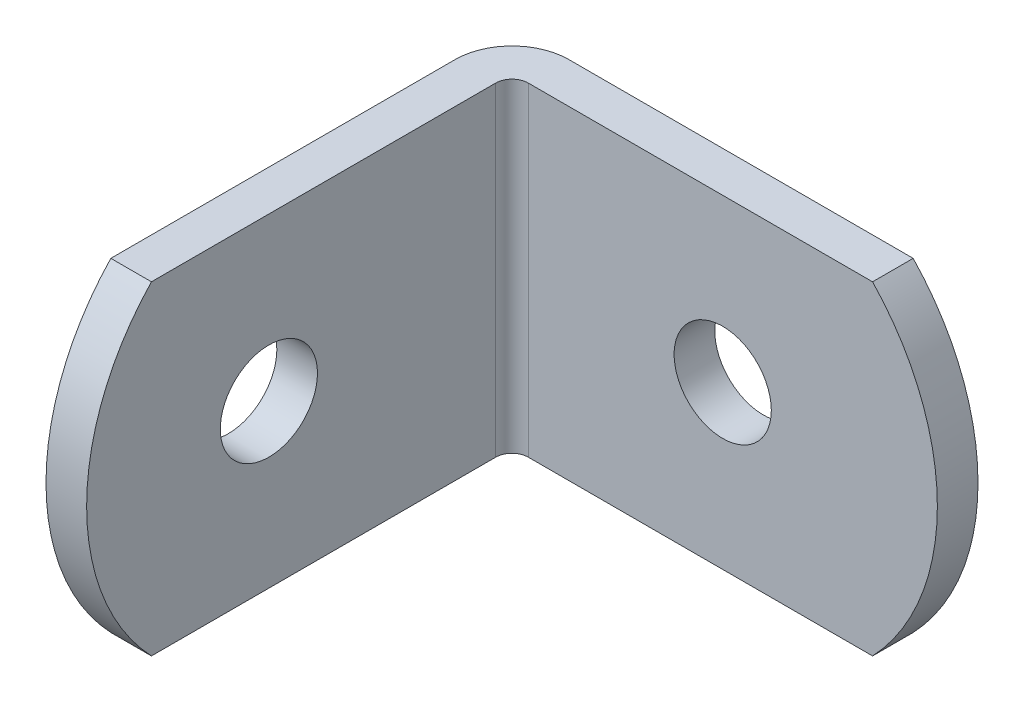
ISO-10303-21;
HEADER;
FILE_DESCRIPTION(('STEP AP214'),'2;1');
FILE_NAME('part.step','',(''),(''),'','','');
FILE_SCHEMA(('AUTOMOTIVE_DESIGN { 1 0 10303 214 1 1 1 1 }'));
ENDSEC;
DATA;
#1=APPLICATION_CONTEXT('core data for automotive mechanical design processes');
#2=APPLICATION_PROTOCOL_DEFINITION('international standard','automotive_design',2000,#1);
#3=PRODUCT_CONTEXT('',#1,'mechanical');
#4=PRODUCT('Part','Part','',(#3));
#5=PRODUCT_RELATED_PRODUCT_CATEGORY('part','',(#4));
#6=PRODUCT_DEFINITION_FORMATION('','',#4);
#7=PRODUCT_DEFINITION_CONTEXT('part definition',#1,'design');
#8=PRODUCT_DEFINITION('design','',#6,#7);
#9=PRODUCT_DEFINITION_SHAPE('','',#8);
#10=(LENGTH_UNIT() NAMED_UNIT(*) SI_UNIT(.MILLI.,.METRE.));
#11=(NAMED_UNIT(*) PLANE_ANGLE_UNIT() SI_UNIT($,.RADIAN.));
#12=(NAMED_UNIT(*) SI_UNIT($,.STERADIAN.) SOLID_ANGLE_UNIT());
#13=UNCERTAINTY_MEASURE_WITH_UNIT(LENGTH_MEASURE(1.E-05),#10,'distance_accuracy_value','');
#14=(GEOMETRIC_REPRESENTATION_CONTEXT(3) GLOBAL_UNCERTAINTY_ASSIGNED_CONTEXT((#13)) GLOBAL_UNIT_ASSIGNED_CONTEXT((#10,
#11,#12)) REPRESENTATION_CONTEXT('',''));
#15=CARTESIAN_POINT('',(0.,0.,0.));
#16=DIRECTION('',(0.,0.,1.));
#17=DIRECTION('',(1.,0.,0.));
#18=AXIS2_PLACEMENT_3D('',#15,#16,#17);
#19=CARTESIAN_POINT('',(73.5960459180228,0.,11.41095));
#20=DIRECTION('',(-1.,0.,0.));
#21=DIRECTION('',(0.,0.,1.));
#22=AXIS2_PLACEMENT_3D('',#19,#20,#21);
#23=CYLINDRICAL_SURFACE('',#22,11.60145);
#24=DIRECTION('',(-1.,0.,0.));
#25=VECTOR('',#24,1.);
#26=CARTESIAN_POINT('',(73.5960459180228,-8.001,19.812));
#27=LINE('',#26,#25);
#28=CARTESIAN_POINT('',(0.,-8.001,19.812));
#29=VERTEX_POINT('',#28);
#30=CARTESIAN_POINT('',(2.0066,-8.001,19.812));
#31=VERTEX_POINT('',#30);
#32=EDGE_CURVE('E49',#29,#31,#27,.F.);
#33=ORIENTED_EDGE('',*,*,#32,.T.);
#34=CARTESIAN_POINT('',(2.0066,0.,11.41095));
#35=DIRECTION('',(-1.,0.,0.));
#36=DIRECTION('',(0.,0.,1.));
#37=AXIS2_PLACEMENT_3D('',#34,#35,#36);
#38=CIRCLE('',#37,11.60145);
#39=CARTESIAN_POINT('',(2.0066,8.001,19.812));
#40=VERTEX_POINT('',#39);
#41=EDGE_CURVE('E136',#40,#31,#38,.F.);
#42=ORIENTED_EDGE('',*,*,#41,.F.);
#43=DIRECTION('',(-1.,0.,0.));
#44=VECTOR('',#43,1.);
#45=CARTESIAN_POINT('',(73.5960459180228,8.001,19.812));
#46=LINE('',#45,#44);
#47=CARTESIAN_POINT('',(0.,8.001,19.812));
#48=VERTEX_POINT('',#47);
#49=EDGE_CURVE('E132',#40,#48,#46,.T.);
#50=ORIENTED_EDGE('',*,*,#49,.T.);
#51=CARTESIAN_POINT('',(0.,0.,11.41095));
#52=DIRECTION('',(-1.,0.,0.));
#53=DIRECTION('',(0.,0.,1.));
#54=AXIS2_PLACEMENT_3D('',#51,#52,#53);
#55=CIRCLE('',#54,11.60145);
#56=EDGE_CURVE('E138',#48,#29,#55,.F.);
#57=ORIENTED_EDGE('',*,*,#56,.T.);
#58=EDGE_LOOP('',(#33,#42,#50,#57));
#59=FACE_BOUND('',#58,.T.);
#60=ADVANCED_FACE('F41',(#59),#23,.T.);
#61=CARTESIAN_POINT('',(2.80924,8.001,2.0066));
#62=DIRECTION('',(0.,0.,-1.));
#63=DIRECTION('',(-1.,0.,0.));
#64=AXIS2_PLACEMENT_3D('',#61,#62,#63);
#65=PLANE('',#64);
#66=CARTESIAN_POINT('',(12.4124,0.,2.0066));
#67=DIRECTION('',(0.,0.,1.));
#68=DIRECTION('',(1.,0.,0.));
#69=AXIS2_PLACEMENT_3D('',#66,#67,#68);
#70=CIRCLE('',#69,2.4);
#71=CARTESIAN_POINT('',(14.8124,0.,2.0066));
#72=VERTEX_POINT('',#71);
#73=EDGE_CURVE('E188',#72,#72,#70,.T.);
#74=ORIENTED_EDGE('',*,*,#73,.F.);
#75=EDGE_LOOP('',(#74));
#76=FACE_BOUND('',#75,.T.);
#77=DIRECTION('',(1.,0.,0.));
#78=VECTOR('',#77,1.);
#79=CARTESIAN_POINT('',(2.80924,-8.001,2.0066));
#80=LINE('',#79,#78);
#81=CARTESIAN_POINT('',(2.80924,-8.001,2.0066));
#82=VERTEX_POINT('',#81);
#83=CARTESIAN_POINT('',(19.812,-8.001,2.0066));
#84=VERTEX_POINT('',#83);
#85=EDGE_CURVE('E115',#82,#84,#80,.T.);
#86=ORIENTED_EDGE('',*,*,#85,.T.);
#87=CARTESIAN_POINT('',(11.41095,0.,2.0066));
#88=DIRECTION('',(0.,0.,-1.));
#89=DIRECTION('',(-1.,0.,0.));
#90=AXIS2_PLACEMENT_3D('',#87,#88,#89);
#91=CIRCLE('',#90,11.60145);
#92=CARTESIAN_POINT('',(19.812,8.001,2.0066));
#93=VERTEX_POINT('',#92);
#94=EDGE_CURVE('E63',#84,#93,#91,.F.);
#95=ORIENTED_EDGE('',*,*,#94,.T.);
#96=DIRECTION('',(1.,0.,0.));
#97=VECTOR('',#96,1.);
#98=CARTESIAN_POINT('',(2.80924,8.001,2.0066));
#99=LINE('',#98,#97);
#100=CARTESIAN_POINT('',(2.80924,8.001,2.0066));
#101=VERTEX_POINT('',#100);
#102=EDGE_CURVE('E141',#101,#93,#99,.T.);
#103=ORIENTED_EDGE('',*,*,#102,.F.);
#104=DIRECTION('',(0.,-1.,0.));
#105=VECTOR('',#104,1.);
#106=CARTESIAN_POINT('',(2.80924,8.001,2.0066));
#107=LINE('',#106,#105);
#108=EDGE_CURVE('E154',#101,#82,#107,.T.);
#109=ORIENTED_EDGE('',*,*,#108,.T.);
#110=EDGE_LOOP('',(#86,#95,#103,#109));
#111=FACE_BOUND('',#110,.T.);
#112=ADVANCED_FACE('F43',(#76,#111),#65,.F.);
#113=CARTESIAN_POINT('',(2.80924,8.001,0.));
#114=DIRECTION('',(0.,0.,-1.));
#115=DIRECTION('',(-1.,0.,0.));
#116=AXIS2_PLACEMENT_3D('',#113,#114,#115);
#117=PLANE('',#116);
#118=CARTESIAN_POINT('',(12.4124,0.,0.));
#119=DIRECTION('',(0.,0.,1.));
#120=DIRECTION('',(1.,0.,0.));
#121=AXIS2_PLACEMENT_3D('',#118,#119,#120);
#122=CIRCLE('',#121,2.4);
#123=CARTESIAN_POINT('',(14.8124,0.,0.));
#124=VERTEX_POINT('',#123);
#125=EDGE_CURVE('E186',#124,#124,#122,.T.);
#126=ORIENTED_EDGE('',*,*,#125,.T.);
#127=EDGE_LOOP('',(#126));
#128=FACE_BOUND('',#127,.T.);
#129=CARTESIAN_POINT('',(11.41095,0.,0.));
#130=DIRECTION('',(0.,0.,-1.));
#131=DIRECTION('',(-1.,0.,0.));
#132=AXIS2_PLACEMENT_3D('',#129,#130,#131);
#133=CIRCLE('',#132,11.60145);
#134=CARTESIAN_POINT('',(19.812,-8.001,0.));
#135=VERTEX_POINT('',#134);
#136=CARTESIAN_POINT('',(19.812,8.001,0.));
#137=VERTEX_POINT('',#136);
#138=EDGE_CURVE('E55',#135,#137,#133,.F.);
#139=ORIENTED_EDGE('',*,*,#138,.F.);
#140=DIRECTION('',(1.,0.,0.));
#141=VECTOR('',#140,1.);
#142=CARTESIAN_POINT('',(2.80924,-8.001,0.));
#143=LINE('',#142,#141);
#144=CARTESIAN_POINT('',(2.80924,-8.001,0.));
#145=VERTEX_POINT('',#144);
#146=EDGE_CURVE('E109',#145,#135,#143,.T.);
#147=ORIENTED_EDGE('',*,*,#146,.F.);
#148=DIRECTION('',(0.,-1.,0.));
#149=VECTOR('',#148,1.);
#150=CARTESIAN_POINT('',(2.80924,8.001,0.));
#151=LINE('',#150,#149);
#152=CARTESIAN_POINT('',(2.80924,8.001,0.));
#153=VERTEX_POINT('',#152);
#154=EDGE_CURVE('E170',#153,#145,#151,.T.);
#155=ORIENTED_EDGE('',*,*,#154,.F.);
#156=DIRECTION('',(1.,0.,0.));
#157=VECTOR('',#156,1.);
#158=CARTESIAN_POINT('',(2.80924,8.001,0.));
#159=LINE('',#158,#157);
#160=EDGE_CURVE('E120',#153,#137,#159,.T.);
#161=ORIENTED_EDGE('',*,*,#160,.T.);
#162=EDGE_LOOP('',(#139,#147,#155,#161));
#163=FACE_BOUND('',#162,.T.);
#164=ADVANCED_FACE('F118',(#128,#163),#117,.T.);
#165=CARTESIAN_POINT('',(2.80924,8.001,2.80924));
#166=DIRECTION('',(0.,-1.,0.));
#167=DIRECTION('',(0.,0.,-1.));
#168=AXIS2_PLACEMENT_3D('',#165,#166,#167);
#169=CYLINDRICAL_SURFACE('',#168,2.80924);
#170=CARTESIAN_POINT('',(2.80924,-8.001,2.80924));
#171=DIRECTION('',(0.,-1.,0.));
#172=DIRECTION('',(0.,0.,1.));
#173=AXIS2_PLACEMENT_3D('',#170,#171,#172);
#174=CIRCLE('',#173,2.80924);
#175=CARTESIAN_POINT('',(0.,-8.001,2.80924));
#176=VERTEX_POINT('',#175);
#177=EDGE_CURVE('E113',#176,#145,#174,.T.);
#178=ORIENTED_EDGE('',*,*,#177,.F.);
#179=DIRECTION('',(0.,-1.,0.));
#180=VECTOR('',#179,1.);
#181=CARTESIAN_POINT('',(0.,8.001,2.80924));
#182=LINE('',#181,#180);
#183=CARTESIAN_POINT('',(0.,8.001,2.80924));
#184=VERTEX_POINT('',#183);
#185=EDGE_CURVE('E167',#184,#176,#182,.T.);
#186=ORIENTED_EDGE('',*,*,#185,.F.);
#187=CARTESIAN_POINT('',(2.80924,8.001,2.80924));
#188=DIRECTION('',(0.,-1.,0.));
#189=DIRECTION('',(0.,0.,1.));
#190=AXIS2_PLACEMENT_3D('',#187,#188,#189);
#191=CIRCLE('',#190,2.80924);
#192=EDGE_CURVE('E145',#184,#153,#191,.T.);
#193=ORIENTED_EDGE('',*,*,#192,.T.);
#194=ORIENTED_EDGE('',*,*,#154,.T.);
#195=EDGE_LOOP('',(#178,#186,#193,#194));
#196=FACE_BOUND('',#195,.T.);
#197=ADVANCED_FACE('F183',(#196),#169,.T.);
#198=CARTESIAN_POINT('',(0.,8.001,2.80924));
#199=DIRECTION('',(-1.,0.,0.));
#200=DIRECTION('',(0.,0.,1.));
#201=AXIS2_PLACEMENT_3D('',#198,#199,#200);
#202=PLANE('',#201);
#203=CARTESIAN_POINT('',(0.,0.,14.0124));
#204=DIRECTION('',(1.,0.,0.));
#205=DIRECTION('',(0.,0.,-1.));
#206=AXIS2_PLACEMENT_3D('',#203,#204,#205);
#207=CIRCLE('',#206,2.4);
#208=CARTESIAN_POINT('',(0.,0.,11.6124));
#209=VERTEX_POINT('',#208);
#210=EDGE_CURVE('E127',#209,#209,#207,.T.);
#211=ORIENTED_EDGE('',*,*,#210,.T.);
#212=EDGE_LOOP('',(#211));
#213=FACE_BOUND('',#212,.T.);
#214=ORIENTED_EDGE('',*,*,#56,.F.);
#215=DIRECTION('',(0.,0.,-1.));
#216=VECTOR('',#215,1.);
#217=CARTESIAN_POINT('',(0.,8.001,2.80924));
#218=LINE('',#217,#216);
#219=EDGE_CURVE('E148',#48,#184,#218,.T.);
#220=ORIENTED_EDGE('',*,*,#219,.T.);
#221=ORIENTED_EDGE('',*,*,#185,.T.);
#222=DIRECTION('',(0.,0.,-1.));
#223=VECTOR('',#222,1.);
#224=CARTESIAN_POINT('',(0.,-8.001,2.80924));
#225=LINE('',#224,#223);
#226=EDGE_CURVE('E157',#29,#176,#225,.T.);
#227=ORIENTED_EDGE('',*,*,#226,.F.);
#228=EDGE_LOOP('',(#214,#220,#221,#227));
#229=FACE_BOUND('',#228,.T.);
#230=ADVANCED_FACE('F178',(#213,#229),#202,.T.);
#231=CARTESIAN_POINT('',(2.0066,8.001,2.80924));
#232=DIRECTION('',(-1.,0.,0.));
#233=DIRECTION('',(0.,0.,1.));
#234=AXIS2_PLACEMENT_3D('',#231,#232,#233);
#235=PLANE('',#234);
#236=CARTESIAN_POINT('',(2.0066,0.,14.0124));
#237=DIRECTION('',(1.,0.,0.));
#238=DIRECTION('',(0.,0.,-1.));
#239=AXIS2_PLACEMENT_3D('',#236,#237,#238);
#240=CIRCLE('',#239,2.4);
#241=CARTESIAN_POINT('',(2.0066,0.,11.6124));
#242=VERTEX_POINT('',#241);
#243=EDGE_CURVE('E124',#242,#242,#240,.T.);
#244=ORIENTED_EDGE('',*,*,#243,.F.);
#245=EDGE_LOOP('',(#244));
#246=FACE_BOUND('',#245,.T.);
#247=ORIENTED_EDGE('',*,*,#41,.T.);
#248=DIRECTION('',(0.,0.,-1.));
#249=VECTOR('',#248,1.);
#250=CARTESIAN_POINT('',(2.0066,-8.001,2.80924));
#251=LINE('',#250,#249);
#252=CARTESIAN_POINT('',(2.0066,-8.001,2.80924));
#253=VERTEX_POINT('',#252);
#254=EDGE_CURVE('E159',#31,#253,#251,.T.);
#255=ORIENTED_EDGE('',*,*,#254,.T.);
#256=DIRECTION('',(0.,-1.,0.));
#257=VECTOR('',#256,1.);
#258=CARTESIAN_POINT('',(2.0066,8.001,2.80924));
#259=LINE('',#258,#257);
#260=CARTESIAN_POINT('',(2.0066,8.001,2.80924));
#261=VERTEX_POINT('',#260);
#262=EDGE_CURVE('E164',#261,#253,#259,.T.);
#263=ORIENTED_EDGE('',*,*,#262,.F.);
#264=DIRECTION('',(0.,0.,-1.));
#265=VECTOR('',#264,1.);
#266=CARTESIAN_POINT('',(2.0066,8.001,2.80924));
#267=LINE('',#266,#265);
#268=EDGE_CURVE('E150',#40,#261,#267,.T.);
#269=ORIENTED_EDGE('',*,*,#268,.F.);
#270=EDGE_LOOP('',(#247,#255,#263,#269));
#271=FACE_BOUND('',#270,.T.);
#272=ADVANCED_FACE('F204',(#246,#271),#235,.F.);
#273=CARTESIAN_POINT('',(2.80924,8.001,2.80924));
#274=DIRECTION('',(0.,-1.,0.));
#275=DIRECTION('',(0.,0.,-1.));
#276=AXIS2_PLACEMENT_3D('',#273,#274,#275);
#277=CYLINDRICAL_SURFACE('',#276,0.80264);
#278=CARTESIAN_POINT('',(2.80924,-8.001,2.80924));
#279=DIRECTION('',(0.,1.,0.));
#280=DIRECTION('',(1.,0.,0.));
#281=AXIS2_PLACEMENT_3D('',#278,#279,#280);
#282=CIRCLE('',#281,0.80264);
#283=EDGE_CURVE('E143',#253,#82,#282,.F.);
#284=ORIENTED_EDGE('',*,*,#283,.T.);
#285=ORIENTED_EDGE('',*,*,#108,.F.);
#286=CARTESIAN_POINT('',(2.80924,8.001,2.80924));
#287=DIRECTION('',(0.,1.,0.));
#288=DIRECTION('',(1.,0.,0.));
#289=AXIS2_PLACEMENT_3D('',#286,#287,#288);
#290=CIRCLE('',#289,0.80264);
#291=EDGE_CURVE('E152',#261,#101,#290,.F.);
#292=ORIENTED_EDGE('',*,*,#291,.F.);
#293=ORIENTED_EDGE('',*,*,#262,.T.);
#294=EDGE_LOOP('',(#284,#285,#292,#293));
#295=FACE_BOUND('',#294,.T.);
#296=ADVANCED_FACE('F199',(#295),#277,.F.);
#297=CARTESIAN_POINT('',(2.80924,8.001,2.80924));
#298=DIRECTION('',(0.,-1.,0.));
#299=DIRECTION('',(-1.,0.,0.));
#300=AXIS2_PLACEMENT_3D('',#297,#298,#299);
#301=PLANE('',#300);
#302=ORIENTED_EDGE('',*,*,#102,.T.);
#303=DIRECTION('',(0.,0.,-1.));
#304=VECTOR('',#303,1.);
#305=CARTESIAN_POINT('',(19.812,8.001,69.5955459180228));
#306=LINE('',#305,#304);
#307=EDGE_CURVE('E121',#93,#137,#306,.T.);
#308=ORIENTED_EDGE('',*,*,#307,.T.);
#309=ORIENTED_EDGE('',*,*,#160,.F.);
#310=ORIENTED_EDGE('',*,*,#192,.F.);
#311=ORIENTED_EDGE('',*,*,#219,.F.);
#312=ORIENTED_EDGE('',*,*,#49,.F.);
#313=ORIENTED_EDGE('',*,*,#268,.T.);
#314=ORIENTED_EDGE('',*,*,#291,.T.);
#315=EDGE_LOOP('',(#302,#308,#309,#310,#311,#312,#313,#314));
#316=FACE_BOUND('',#315,.T.);
#317=ADVANCED_FACE('F185',(#316),#301,.F.);
#318=CARTESIAN_POINT('',(2.80924,-8.001,2.80924));
#319=DIRECTION('',(0.,-1.,0.));
#320=DIRECTION('',(-1.,0.,0.));
#321=AXIS2_PLACEMENT_3D('',#318,#319,#320);
#322=PLANE('',#321);
#323=DIRECTION('',(0.,0.,-1.));
#324=VECTOR('',#323,1.);
#325=CARTESIAN_POINT('',(19.812,-8.001,69.5955459180228));
#326=LINE('',#325,#324);
#327=EDGE_CURVE('E11',#84,#135,#326,.T.);
#328=ORIENTED_EDGE('',*,*,#327,.F.);
#329=ORIENTED_EDGE('',*,*,#85,.F.);
#330=ORIENTED_EDGE('',*,*,#283,.F.);
#331=ORIENTED_EDGE('',*,*,#254,.F.);
#332=ORIENTED_EDGE('',*,*,#32,.F.);
#333=ORIENTED_EDGE('',*,*,#226,.T.);
#334=ORIENTED_EDGE('',*,*,#177,.T.);
#335=ORIENTED_EDGE('',*,*,#146,.T.);
#336=EDGE_LOOP('',(#328,#329,#330,#331,#332,#333,#334,#335));
#337=FACE_BOUND('',#336,.T.);
#338=ADVANCED_FACE('F110',(#337),#322,.T.);
#339=CARTESIAN_POINT('',(0.,0.,14.0124));
#340=DIRECTION('',(1.,0.,0.));
#341=DIRECTION('',(0.,0.,-1.));
#342=AXIS2_PLACEMENT_3D('',#339,#340,#341);
#343=CYLINDRICAL_SURFACE('',#342,2.4);
#344=ORIENTED_EDGE('',*,*,#210,.F.);
#345=EDGE_LOOP('',(#344));
#346=FACE_BOUND('',#345,.T.);
#347=ORIENTED_EDGE('',*,*,#243,.T.);
#348=EDGE_LOOP('',(#347));
#349=FACE_BOUND('',#348,.T.);
#350=ADVANCED_FACE('F222',(#346,#349),#343,.F.);
#351=CARTESIAN_POINT('',(11.41095,0.,69.5955459180228));
#352=DIRECTION('',(0.,0.,-1.));
#353=DIRECTION('',(-1.,0.,0.));
#354=AXIS2_PLACEMENT_3D('',#351,#352,#353);
#355=CYLINDRICAL_SURFACE('',#354,11.60145);
#356=ORIENTED_EDGE('',*,*,#94,.F.);
#357=ORIENTED_EDGE('',*,*,#327,.T.);
#358=ORIENTED_EDGE('',*,*,#138,.T.);
#359=ORIENTED_EDGE('',*,*,#307,.F.);
#360=EDGE_LOOP('',(#356,#357,#358,#359));
#361=FACE_BOUND('',#360,.T.);
#362=ADVANCED_FACE('F123',(#361),#355,.T.);
#363=CARTESIAN_POINT('',(12.4124,0.,0.));
#364=DIRECTION('',(0.,0.,1.));
#365=DIRECTION('',(1.,0.,0.));
#366=AXIS2_PLACEMENT_3D('',#363,#364,#365);
#367=CYLINDRICAL_SURFACE('',#366,2.4);
#368=ORIENTED_EDGE('',*,*,#125,.F.);
#369=EDGE_LOOP('',(#368));
#370=FACE_BOUND('',#369,.T.);
#371=ORIENTED_EDGE('',*,*,#73,.T.);
#372=EDGE_LOOP('',(#371));
#373=FACE_BOUND('',#372,.T.);
#374=ADVANCED_FACE('F194',(#370,#373),#367,.F.);
#375=CLOSED_SHELL('',(#60,#112,#164,#197,#230,#272,#296,#317,#338,#350,#362,#374));
#376=MANIFOLD_SOLID_BREP('B2',#375);
#377=ADVANCED_BREP_SHAPE_REPRESENTATION('',(#18,#376),#14);
#378=SHAPE_DEFINITION_REPRESENTATION(#9,#377);
ENDSEC;
END-ISO-10303-21;
